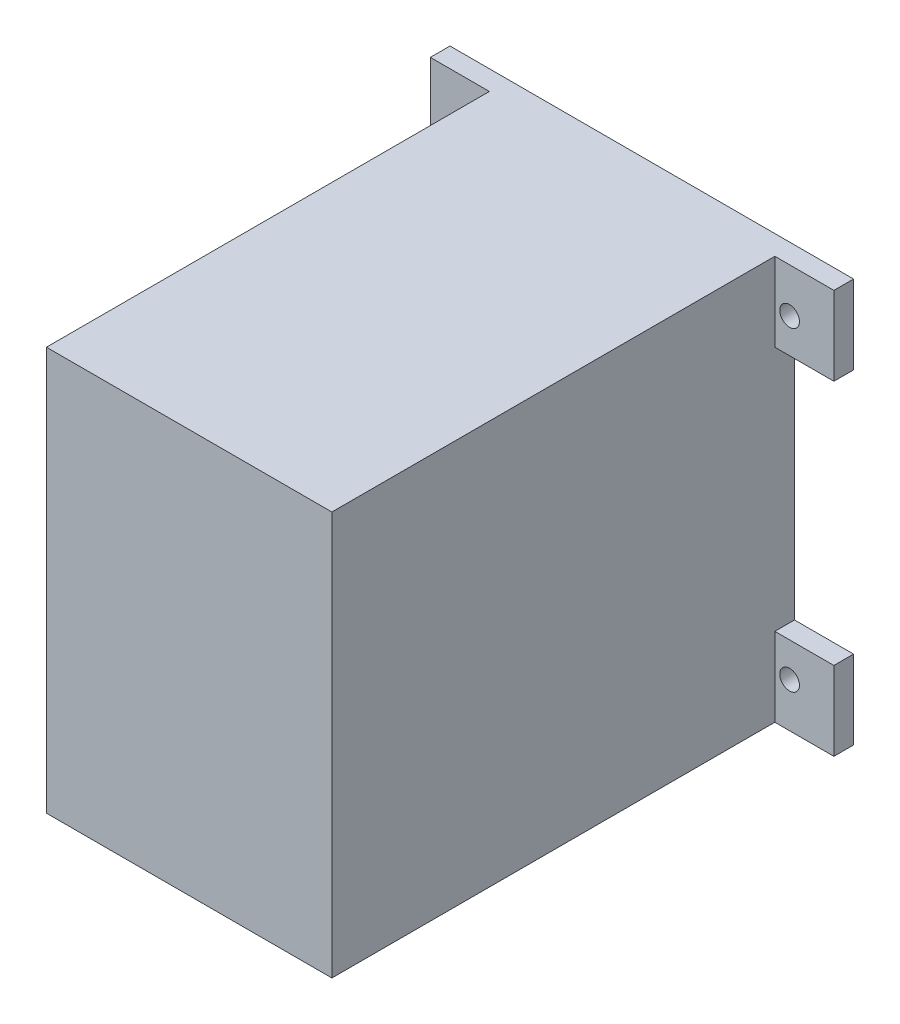
ISO-10303-21;
HEADER;
FILE_DESCRIPTION(('STEP AP214'),'2;1');
FILE_NAME('part.step','',(''),(''),'','','');
FILE_SCHEMA(('AUTOMOTIVE_DESIGN { 1 0 10303 214 1 1 1 1 }'));
ENDSEC;
DATA;
#1=APPLICATION_CONTEXT('core data for automotive mechanical design processes');
#2=APPLICATION_PROTOCOL_DEFINITION('international standard','automotive_design',2000,#1);
#3=PRODUCT_CONTEXT('',#1,'mechanical');
#4=PRODUCT('Part','Part','',(#3));
#5=PRODUCT_RELATED_PRODUCT_CATEGORY('part','',(#4));
#6=PRODUCT_DEFINITION_FORMATION('','',#4);
#7=PRODUCT_DEFINITION_CONTEXT('part definition',#1,'design');
#8=PRODUCT_DEFINITION('design','',#6,#7);
#9=PRODUCT_DEFINITION_SHAPE('','',#8);
#10=(LENGTH_UNIT() NAMED_UNIT(*) SI_UNIT(.MILLI.,.METRE.));
#11=(NAMED_UNIT(*) PLANE_ANGLE_UNIT() SI_UNIT($,.RADIAN.));
#12=(NAMED_UNIT(*) SI_UNIT($,.STERADIAN.) SOLID_ANGLE_UNIT());
#13=UNCERTAINTY_MEASURE_WITH_UNIT(LENGTH_MEASURE(1.E-05),#10,'distance_accuracy_value','');
#14=(GEOMETRIC_REPRESENTATION_CONTEXT(3) GLOBAL_UNCERTAINTY_ASSIGNED_CONTEXT((#13)) GLOBAL_UNIT_ASSIGNED_CONTEXT((#10,
#11,#12)) REPRESENTATION_CONTEXT('',''));
#15=CARTESIAN_POINT('',(0.,0.,0.));
#16=DIRECTION('',(0.,0.,1.));
#17=DIRECTION('',(1.,0.,0.));
#18=AXIS2_PLACEMENT_3D('',#15,#16,#17);
#19=CARTESIAN_POINT('',(-14.5,20.5,0.));
#20=DIRECTION('',(0.,0.,1.));
#21=DIRECTION('',(1.,0.,0.));
#22=AXIS2_PLACEMENT_3D('',#19,#20,#21);
#23=PLANE('',#22);
#24=CARTESIAN_POINT('',(16.,-16.,0.));
#25=DIRECTION('',(0.,0.,1.));
#26=DIRECTION('',(1.,0.,0.));
#27=AXIS2_PLACEMENT_3D('',#24,#25,#26);
#28=CIRCLE('',#27,1.00000000000001);
#29=CARTESIAN_POINT('',(17.,-16.,0.));
#30=VERTEX_POINT('',#29);
#31=EDGE_CURVE('E616',#30,#30,#28,.T.);
#32=ORIENTED_EDGE('',*,*,#31,.T.);
#33=EDGE_LOOP('',(#32));
#34=FACE_BOUND('',#33,.T.);
#35=CARTESIAN_POINT('',(-16.,16.,0.));
#36=DIRECTION('',(0.,0.,1.));
#37=DIRECTION('',(1.,0.,0.));
#38=AXIS2_PLACEMENT_3D('',#35,#36,#37);
#39=CIRCLE('',#38,1.);
#40=CARTESIAN_POINT('',(-15.,16.,0.));
#41=VERTEX_POINT('',#40);
#42=EDGE_CURVE('E627',#41,#41,#39,.T.);
#43=ORIENTED_EDGE('',*,*,#42,.T.);
#44=EDGE_LOOP('',(#43));
#45=FACE_BOUND('',#44,.T.);
#46=DIRECTION('',(0.,-1.,0.));
#47=VECTOR('',#46,1.);
#48=CARTESIAN_POINT('',(-14.5,-20.5,0.));
#49=LINE('',#48,#47);
#50=CARTESIAN_POINT('',(-14.5,12.5,0.));
#51=VERTEX_POINT('',#50);
#52=CARTESIAN_POINT('',(-14.5,-12.5,0.));
#53=VERTEX_POINT('',#52);
#54=EDGE_CURVE('E35',#51,#53,#49,.T.);
#55=ORIENTED_EDGE('',*,*,#54,.F.);
#56=DIRECTION('',(1.,0.,0.));
#57=VECTOR('',#56,1.);
#58=CARTESIAN_POINT('',(-14.5,12.5,0.));
#59=LINE('',#58,#57);
#60=CARTESIAN_POINT('',(-20.5,12.5,0.));
#61=VERTEX_POINT('',#60);
#62=EDGE_CURVE('E199',#61,#51,#59,.T.);
#63=ORIENTED_EDGE('',*,*,#62,.F.);
#64=DIRECTION('',(0.,-1.,0.));
#65=VECTOR('',#64,1.);
#66=CARTESIAN_POINT('',(-20.5,20.5,0.));
#67=LINE('',#66,#65);
#68=CARTESIAN_POINT('',(-20.5,20.5,0.));
#69=VERTEX_POINT('',#68);
#70=EDGE_CURVE('E197',#69,#61,#67,.T.);
#71=ORIENTED_EDGE('',*,*,#70,.F.);
#72=DIRECTION('',(-1.,0.,0.));
#73=VECTOR('',#72,1.);
#74=CARTESIAN_POINT('',(14.5,20.5,0.));
#75=LINE('',#74,#73);
#76=CARTESIAN_POINT('',(20.5,20.5,0.));
#77=VERTEX_POINT('',#76);
#78=EDGE_CURVE('E183',#77,#69,#75,.T.);
#79=ORIENTED_EDGE('',*,*,#78,.F.);
#80=DIRECTION('',(0.,1.,0.));
#81=VECTOR('',#80,1.);
#82=CARTESIAN_POINT('',(20.5,20.5,0.));
#83=LINE('',#82,#81);
#84=CARTESIAN_POINT('',(20.5,12.5,0.));
#85=VERTEX_POINT('',#84);
#86=EDGE_CURVE('E312',#85,#77,#83,.T.);
#87=ORIENTED_EDGE('',*,*,#86,.F.);
#88=DIRECTION('',(1.,0.,0.));
#89=VECTOR('',#88,1.);
#90=CARTESIAN_POINT('',(14.5,12.5,0.));
#91=LINE('',#90,#89);
#92=CARTESIAN_POINT('',(14.5,12.5,0.));
#93=VERTEX_POINT('',#92);
#94=EDGE_CURVE('E310',#93,#85,#91,.T.);
#95=ORIENTED_EDGE('',*,*,#94,.F.);
#96=DIRECTION('',(0.,1.,0.));
#97=VECTOR('',#96,1.);
#98=CARTESIAN_POINT('',(14.5,-20.5,0.));
#99=LINE('',#98,#97);
#100=CARTESIAN_POINT('',(14.5,-12.5,0.));
#101=VERTEX_POINT('',#100);
#102=EDGE_CURVE('E240',#101,#93,#99,.T.);
#103=ORIENTED_EDGE('',*,*,#102,.F.);
#104=DIRECTION('',(-1.,0.,0.));
#105=VECTOR('',#104,1.);
#106=CARTESIAN_POINT('',(14.5,-12.5,0.));
#107=LINE('',#106,#105);
#108=CARTESIAN_POINT('',(20.5,-12.5,0.));
#109=VERTEX_POINT('',#108);
#110=EDGE_CURVE('E365',#109,#101,#107,.T.);
#111=ORIENTED_EDGE('',*,*,#110,.F.);
#112=DIRECTION('',(0.,1.,0.));
#113=VECTOR('',#112,1.);
#114=CARTESIAN_POINT('',(20.5,-20.5,0.));
#115=LINE('',#114,#113);
#116=CARTESIAN_POINT('',(20.5,-20.5,0.));
#117=VERTEX_POINT('',#116);
#118=EDGE_CURVE('E227',#117,#109,#115,.T.);
#119=ORIENTED_EDGE('',*,*,#118,.F.);
#120=DIRECTION('',(1.,0.,0.));
#121=VECTOR('',#120,1.);
#122=CARTESIAN_POINT('',(14.5,-20.5,0.));
#123=LINE('',#122,#121);
#124=CARTESIAN_POINT('',(-20.5,-20.5,0.));
#125=VERTEX_POINT('',#124);
#126=EDGE_CURVE('E260',#125,#117,#123,.T.);
#127=ORIENTED_EDGE('',*,*,#126,.F.);
#128=DIRECTION('',(0.,-1.,0.));
#129=VECTOR('',#128,1.);
#130=CARTESIAN_POINT('',(-20.5,-20.5,0.));
#131=LINE('',#130,#129);
#132=CARTESIAN_POINT('',(-20.5,-12.5,0.));
#133=VERTEX_POINT('',#132);
#134=EDGE_CURVE('E211',#133,#125,#131,.T.);
#135=ORIENTED_EDGE('',*,*,#134,.F.);
#136=DIRECTION('',(-1.,0.,0.));
#137=VECTOR('',#136,1.);
#138=CARTESIAN_POINT('',(-14.5,-12.5,0.));
#139=LINE('',#138,#137);
#140=EDGE_CURVE('E186',#53,#133,#139,.T.);
#141=ORIENTED_EDGE('',*,*,#140,.F.);
#142=EDGE_LOOP('',(#55,#63,#71,#79,#87,#95,#103,#111,#119,#127,#135,#141));
#143=FACE_BOUND('',#142,.T.);
#144=DIRECTION('',(0.,-1.,0.));
#145=VECTOR('',#144,1.);
#146=CARTESIAN_POINT('',(-13.25,-19.25,0.));
#147=LINE('',#146,#145);
#148=CARTESIAN_POINT('',(-13.25,19.25,0.));
#149=VERTEX_POINT('',#148);
#150=CARTESIAN_POINT('',(-13.25,-19.25,0.));
#151=VERTEX_POINT('',#150);
#152=EDGE_CURVE('E291',#149,#151,#147,.T.);
#153=ORIENTED_EDGE('',*,*,#152,.T.);
#154=DIRECTION('',(1.,0.,0.));
#155=VECTOR('',#154,1.);
#156=CARTESIAN_POINT('',(13.25,-19.25,0.));
#157=LINE('',#156,#155);
#158=CARTESIAN_POINT('',(13.25,-19.25,0.));
#159=VERTEX_POINT('',#158);
#160=EDGE_CURVE('E288',#151,#159,#157,.T.);
#161=ORIENTED_EDGE('',*,*,#160,.T.);
#162=DIRECTION('',(0.,1.,0.));
#163=VECTOR('',#162,1.);
#164=CARTESIAN_POINT('',(13.25,-19.25,0.));
#165=LINE('',#164,#163);
#166=CARTESIAN_POINT('',(13.25,19.25,0.));
#167=VERTEX_POINT('',#166);
#168=EDGE_CURVE('E285',#159,#167,#165,.T.);
#169=ORIENTED_EDGE('',*,*,#168,.T.);
#170=DIRECTION('',(-1.,0.,0.));
#171=VECTOR('',#170,1.);
#172=CARTESIAN_POINT('',(13.25,19.25,0.));
#173=LINE('',#172,#171);
#174=EDGE_CURVE('E281',#167,#149,#173,.T.);
#175=ORIENTED_EDGE('',*,*,#174,.T.);
#176=EDGE_LOOP('',(#153,#161,#169,#175));
#177=FACE_BOUND('',#176,.T.);
#178=CARTESIAN_POINT('',(-16.,-16.,0.));
#179=DIRECTION('',(0.,0.,1.));
#180=DIRECTION('',(1.,0.,0.));
#181=AXIS2_PLACEMENT_3D('',#178,#179,#180);
#182=CIRCLE('',#181,1.);
#183=CARTESIAN_POINT('',(-15.,-16.,0.));
#184=VERTEX_POINT('',#183);
#185=EDGE_CURVE('E622',#184,#184,#182,.T.);
#186=ORIENTED_EDGE('',*,*,#185,.T.);
#187=EDGE_LOOP('',(#186));
#188=FACE_BOUND('',#187,.T.);
#189=CARTESIAN_POINT('',(16.,16.,0.));
#190=DIRECTION('',(0.,0.,1.));
#191=DIRECTION('',(1.,0.,0.));
#192=AXIS2_PLACEMENT_3D('',#189,#190,#191);
#193=CIRCLE('',#192,1.);
#194=CARTESIAN_POINT('',(17.,16.,0.));
#195=VERTEX_POINT('',#194);
#196=EDGE_CURVE('E613',#195,#195,#193,.T.);
#197=ORIENTED_EDGE('',*,*,#196,.T.);
#198=EDGE_LOOP('',(#197));
#199=FACE_BOUND('',#198,.T.);
#200=ADVANCED_FACE('F31',(#34,#45,#143,#177,#188,#199),#23,.F.);
#201=CARTESIAN_POINT('',(14.5,12.5,2.));
#202=DIRECTION('',(0.,0.,1.));
#203=DIRECTION('',(1.,0.,0.));
#204=AXIS2_PLACEMENT_3D('',#201,#202,#203);
#205=PLANE('',#204);
#206=DIRECTION('',(0.,-1.,0.));
#207=VECTOR('',#206,1.);
#208=CARTESIAN_POINT('',(14.5,20.5,2.));
#209=LINE('',#208,#207);
#210=CARTESIAN_POINT('',(14.5,20.5,2.));
#211=VERTEX_POINT('',#210);
#212=CARTESIAN_POINT('',(14.5,12.5,2.));
#213=VERTEX_POINT('',#212);
#214=EDGE_CURVE('E251',#211,#213,#209,.T.);
#215=ORIENTED_EDGE('',*,*,#214,.T.);
#216=DIRECTION('',(1.,0.,0.));
#217=VECTOR('',#216,1.);
#218=CARTESIAN_POINT('',(14.5,12.5,2.));
#219=LINE('',#218,#217);
#220=CARTESIAN_POINT('',(20.5,12.5,2.));
#221=VERTEX_POINT('',#220);
#222=EDGE_CURVE('E324',#213,#221,#219,.T.);
#223=ORIENTED_EDGE('',*,*,#222,.T.);
#224=DIRECTION('',(0.,1.,0.));
#225=VECTOR('',#224,1.);
#226=CARTESIAN_POINT('',(20.5,20.5,2.));
#227=LINE('',#226,#225);
#228=CARTESIAN_POINT('',(20.5,20.5,2.));
#229=VERTEX_POINT('',#228);
#230=EDGE_CURVE('E319',#221,#229,#227,.T.);
#231=ORIENTED_EDGE('',*,*,#230,.T.);
#232=DIRECTION('',(-1.,0.,0.));
#233=VECTOR('',#232,1.);
#234=CARTESIAN_POINT('',(14.5,20.5,2.));
#235=LINE('',#234,#233);
#236=EDGE_CURVE('E316',#229,#211,#235,.T.);
#237=ORIENTED_EDGE('',*,*,#236,.T.);
#238=EDGE_LOOP('',(#215,#223,#231,#237));
#239=FACE_BOUND('',#238,.T.);
#240=CARTESIAN_POINT('',(16.,16.,2.));
#241=DIRECTION('',(0.,0.,1.));
#242=DIRECTION('',(1.,0.,0.));
#243=AXIS2_PLACEMENT_3D('',#240,#241,#242);
#244=CIRCLE('',#243,1.);
#245=CARTESIAN_POINT('',(17.,16.,2.));
#246=VERTEX_POINT('',#245);
#247=EDGE_CURVE('E610',#246,#246,#244,.T.);
#248=ORIENTED_EDGE('',*,*,#247,.F.);
#249=EDGE_LOOP('',(#248));
#250=FACE_BOUND('',#249,.T.);
#251=ADVANCED_FACE('F335',(#239,#250),#205,.T.);
#252=CARTESIAN_POINT('',(14.5,-12.5,2.));
#253=DIRECTION('',(0.,0.,-1.));
#254=DIRECTION('',(-1.,0.,0.));
#255=AXIS2_PLACEMENT_3D('',#252,#253,#254);
#256=PLANE('',#255);
#257=DIRECTION('',(0.,-1.,0.));
#258=VECTOR('',#257,1.);
#259=CARTESIAN_POINT('',(14.5,-20.5,2.));
#260=LINE('',#259,#258);
#261=CARTESIAN_POINT('',(14.5,-12.5,2.));
#262=VERTEX_POINT('',#261);
#263=CARTESIAN_POINT('',(14.5,-20.5,2.));
#264=VERTEX_POINT('',#263);
#265=EDGE_CURVE('E223',#262,#264,#260,.T.);
#266=ORIENTED_EDGE('',*,*,#265,.T.);
#267=DIRECTION('',(1.,0.,0.));
#268=VECTOR('',#267,1.);
#269=CARTESIAN_POINT('',(14.5,-20.5,2.));
#270=LINE('',#269,#268);
#271=CARTESIAN_POINT('',(20.5,-20.5,2.));
#272=VERTEX_POINT('',#271);
#273=EDGE_CURVE('E354',#264,#272,#270,.T.);
#274=ORIENTED_EDGE('',*,*,#273,.T.);
#275=DIRECTION('',(0.,1.,0.));
#276=VECTOR('',#275,1.);
#277=CARTESIAN_POINT('',(20.5,-20.5,2.));
#278=LINE('',#277,#276);
#279=CARTESIAN_POINT('',(20.5,-12.5,2.));
#280=VERTEX_POINT('',#279);
#281=EDGE_CURVE('E359',#272,#280,#278,.T.);
#282=ORIENTED_EDGE('',*,*,#281,.T.);
#283=DIRECTION('',(-1.,0.,0.));
#284=VECTOR('',#283,1.);
#285=CARTESIAN_POINT('',(14.5,-12.5,2.));
#286=LINE('',#285,#284);
#287=EDGE_CURVE('E363',#280,#262,#286,.T.);
#288=ORIENTED_EDGE('',*,*,#287,.T.);
#289=EDGE_LOOP('',(#266,#274,#282,#288));
#290=FACE_BOUND('',#289,.T.);
#291=CARTESIAN_POINT('',(16.,-16.,2.));
#292=DIRECTION('',(0.,0.,1.));
#293=DIRECTION('',(1.,0.,0.));
#294=AXIS2_PLACEMENT_3D('',#291,#292,#293);
#295=CIRCLE('',#294,1.00000000000001);
#296=CARTESIAN_POINT('',(17.,-16.,2.));
#297=VERTEX_POINT('',#296);
#298=EDGE_CURVE('E619',#297,#297,#295,.T.);
#299=ORIENTED_EDGE('',*,*,#298,.F.);
#300=EDGE_LOOP('',(#299));
#301=FACE_BOUND('',#300,.T.);
#302=ADVANCED_FACE('F360',(#290,#301),#256,.F.);
#303=CARTESIAN_POINT('',(-14.5,-12.5,2.));
#304=DIRECTION('',(0.,0.,1.));
#305=DIRECTION('',(1.,0.,0.));
#306=AXIS2_PLACEMENT_3D('',#303,#304,#305);
#307=PLANE('',#306);
#308=DIRECTION('',(0.,1.,0.));
#309=VECTOR('',#308,1.);
#310=CARTESIAN_POINT('',(-14.5,-20.5,2.));
#311=LINE('',#310,#309);
#312=CARTESIAN_POINT('',(-14.5,-20.5,2.));
#313=VERTEX_POINT('',#312);
#314=CARTESIAN_POINT('',(-14.5,-12.5,2.));
#315=VERTEX_POINT('',#314);
#316=EDGE_CURVE('E208',#313,#315,#311,.T.);
#317=ORIENTED_EDGE('',*,*,#316,.T.);
#318=DIRECTION('',(-1.,0.,0.));
#319=VECTOR('',#318,1.);
#320=CARTESIAN_POINT('',(-14.5,-12.5,2.));
#321=LINE('',#320,#319);
#322=CARTESIAN_POINT('',(-20.5,-12.5,2.));
#323=VERTEX_POINT('',#322);
#324=EDGE_CURVE('E205',#315,#323,#321,.T.);
#325=ORIENTED_EDGE('',*,*,#324,.T.);
#326=DIRECTION('',(0.,-1.,0.));
#327=VECTOR('',#326,1.);
#328=CARTESIAN_POINT('',(-20.5,-20.5,2.));
#329=LINE('',#328,#327);
#330=CARTESIAN_POINT('',(-20.5,-20.5,2.));
#331=VERTEX_POINT('',#330);
#332=EDGE_CURVE('E207',#323,#331,#329,.T.);
#333=ORIENTED_EDGE('',*,*,#332,.T.);
#334=DIRECTION('',(1.,0.,0.));
#335=VECTOR('',#334,1.);
#336=CARTESIAN_POINT('',(-14.5,-20.5,2.));
#337=LINE('',#336,#335);
#338=EDGE_CURVE('E210',#331,#313,#337,.T.);
#339=ORIENTED_EDGE('',*,*,#338,.T.);
#340=EDGE_LOOP('',(#317,#325,#333,#339));
#341=FACE_BOUND('',#340,.T.);
#342=CARTESIAN_POINT('',(-16.,-16.,2.));
#343=DIRECTION('',(0.,0.,1.));
#344=DIRECTION('',(1.,0.,0.));
#345=AXIS2_PLACEMENT_3D('',#342,#343,#344);
#346=CIRCLE('',#345,1.);
#347=CARTESIAN_POINT('',(-15.,-16.,2.));
#348=VERTEX_POINT('',#347);
#349=EDGE_CURVE('E624',#348,#348,#346,.T.);
#350=ORIENTED_EDGE('',*,*,#349,.F.);
#351=EDGE_LOOP('',(#350));
#352=FACE_BOUND('',#351,.T.);
#353=ADVANCED_FACE('F551',(#341,#352),#307,.T.);
#354=CARTESIAN_POINT('',(-14.5,12.5,2.));
#355=DIRECTION('',(0.,0.,-1.));
#356=DIRECTION('',(-1.,0.,0.));
#357=AXIS2_PLACEMENT_3D('',#354,#355,#356);
#358=PLANE('',#357);
#359=DIRECTION('',(0.,1.,0.));
#360=VECTOR('',#359,1.);
#361=CARTESIAN_POINT('',(-14.5,20.5,2.));
#362=LINE('',#361,#360);
#363=CARTESIAN_POINT('',(-14.5,12.5,2.));
#364=VERTEX_POINT('',#363);
#365=CARTESIAN_POINT('',(-14.5,20.5,2.));
#366=VERTEX_POINT('',#365);
#367=EDGE_CURVE('E49',#364,#366,#362,.T.);
#368=ORIENTED_EDGE('',*,*,#367,.T.);
#369=DIRECTION('',(-1.,0.,0.));
#370=VECTOR('',#369,1.);
#371=CARTESIAN_POINT('',(-14.5,20.5,2.));
#372=LINE('',#371,#370);
#373=CARTESIAN_POINT('',(-20.5,20.5,2.));
#374=VERTEX_POINT('',#373);
#375=EDGE_CURVE('E169',#366,#374,#372,.T.);
#376=ORIENTED_EDGE('',*,*,#375,.T.);
#377=DIRECTION('',(0.,-1.,0.));
#378=VECTOR('',#377,1.);
#379=CARTESIAN_POINT('',(-20.5,20.5,2.));
#380=LINE('',#379,#378);
#381=CARTESIAN_POINT('',(-20.5,12.5,2.));
#382=VERTEX_POINT('',#381);
#383=EDGE_CURVE('E174',#374,#382,#380,.T.);
#384=ORIENTED_EDGE('',*,*,#383,.T.);
#385=DIRECTION('',(1.,0.,0.));
#386=VECTOR('',#385,1.);
#387=CARTESIAN_POINT('',(-14.5,12.5,2.));
#388=LINE('',#387,#386);
#389=EDGE_CURVE('E192',#382,#364,#388,.T.);
#390=ORIENTED_EDGE('',*,*,#389,.T.);
#391=EDGE_LOOP('',(#368,#376,#384,#390));
#392=FACE_BOUND('',#391,.T.);
#393=CARTESIAN_POINT('',(-16.,16.,2.));
#394=DIRECTION('',(0.,0.,1.));
#395=DIRECTION('',(1.,0.,0.));
#396=AXIS2_PLACEMENT_3D('',#393,#394,#395);
#397=CIRCLE('',#396,1.);
#398=CARTESIAN_POINT('',(-15.,16.,2.));
#399=VERTEX_POINT('',#398);
#400=EDGE_CURVE('E200',#399,#399,#397,.T.);
#401=ORIENTED_EDGE('',*,*,#400,.F.);
#402=EDGE_LOOP('',(#401));
#403=FACE_BOUND('',#402,.T.);
#404=ADVANCED_FACE('F171',(#392,#403),#358,.F.);
#405=CARTESIAN_POINT('',(-14.5,-20.5,47.));
#406=DIRECTION('',(1.,0.,0.));
#407=DIRECTION('',(0.,0.,-1.));
#408=AXIS2_PLACEMENT_3D('',#405,#406,#407);
#409=PLANE('',#408);
#410=DIRECTION('',(0.,0.,-1.));
#411=VECTOR('',#410,1.);
#412=CARTESIAN_POINT('',(-14.5,12.5,2.));
#413=LINE('',#412,#411);
#414=EDGE_CURVE('E54',#364,#51,#413,.T.);
#415=ORIENTED_EDGE('',*,*,#414,.T.);
#416=ORIENTED_EDGE('',*,*,#54,.T.);
#417=DIRECTION('',(0.,0.,-1.));
#418=VECTOR('',#417,1.);
#419=CARTESIAN_POINT('',(-14.5,-12.5,2.));
#420=LINE('',#419,#418);
#421=EDGE_CURVE('E220',#315,#53,#420,.T.);
#422=ORIENTED_EDGE('',*,*,#421,.F.);
#423=ORIENTED_EDGE('',*,*,#316,.F.);
#424=DIRECTION('',(0.,0.,-1.));
#425=VECTOR('',#424,1.);
#426=CARTESIAN_POINT('',(-14.5,-20.5,47.));
#427=LINE('',#426,#425);
#428=CARTESIAN_POINT('',(-14.5,-20.5,47.));
#429=VERTEX_POINT('',#428);
#430=EDGE_CURVE('E11',#429,#313,#427,.T.);
#431=ORIENTED_EDGE('',*,*,#430,.F.);
#432=DIRECTION('',(0.,-1.,0.));
#433=VECTOR('',#432,1.);
#434=CARTESIAN_POINT('',(-14.5,-20.5,47.));
#435=LINE('',#434,#433);
#436=CARTESIAN_POINT('',(-14.5,20.5,47.));
#437=VERTEX_POINT('',#436);
#438=EDGE_CURVE('E257',#437,#429,#435,.T.);
#439=ORIENTED_EDGE('',*,*,#438,.F.);
#440=DIRECTION('',(0.,0.,-1.));
#441=VECTOR('',#440,1.);
#442=CARTESIAN_POINT('',(-14.5,20.5,47.));
#443=LINE('',#442,#441);
#444=EDGE_CURVE('E250',#437,#366,#443,.T.);
#445=ORIENTED_EDGE('',*,*,#444,.T.);
#446=ORIENTED_EDGE('',*,*,#367,.F.);
#447=EDGE_LOOP('',(#415,#416,#422,#423,#431,#439,#445,#446));
#448=FACE_BOUND('',#447,.T.);
#449=ADVANCED_FACE('F33',(#448),#409,.F.);
#450=CARTESIAN_POINT('',(14.5,-20.5,47.));
#451=DIRECTION('',(-1.,0.,0.));
#452=DIRECTION('',(0.,0.,1.));
#453=AXIS2_PLACEMENT_3D('',#450,#451,#452);
#454=PLANE('',#453);
#455=DIRECTION('',(0.,0.,-1.));
#456=VECTOR('',#455,1.);
#457=CARTESIAN_POINT('',(14.5,-12.5,2.));
#458=LINE('',#457,#456);
#459=EDGE_CURVE('E374',#262,#101,#458,.T.);
#460=ORIENTED_EDGE('',*,*,#459,.T.);
#461=ORIENTED_EDGE('',*,*,#102,.T.);
#462=DIRECTION('',(0.,0.,-1.));
#463=VECTOR('',#462,1.);
#464=CARTESIAN_POINT('',(14.5,12.5,2.));
#465=LINE('',#464,#463);
#466=EDGE_CURVE('E294',#213,#93,#465,.T.);
#467=ORIENTED_EDGE('',*,*,#466,.F.);
#468=ORIENTED_EDGE('',*,*,#214,.F.);
#469=DIRECTION('',(0.,0.,-1.));
#470=VECTOR('',#469,1.);
#471=CARTESIAN_POINT('',(14.5,20.5,47.));
#472=LINE('',#471,#470);
#473=CARTESIAN_POINT('',(14.5,20.5,47.));
#474=VERTEX_POINT('',#473);
#475=EDGE_CURVE('E247',#474,#211,#472,.T.);
#476=ORIENTED_EDGE('',*,*,#475,.F.);
#477=DIRECTION('',(0.,1.,0.));
#478=VECTOR('',#477,1.);
#479=CARTESIAN_POINT('',(14.5,-20.5,47.));
#480=LINE('',#479,#478);
#481=CARTESIAN_POINT('',(14.5,-20.5,47.));
#482=VERTEX_POINT('',#481);
#483=EDGE_CURVE('E264',#482,#474,#480,.T.);
#484=ORIENTED_EDGE('',*,*,#483,.F.);
#485=DIRECTION('',(0.,0.,-1.));
#486=VECTOR('',#485,1.);
#487=CARTESIAN_POINT('',(14.5,-20.5,47.));
#488=LINE('',#487,#486);
#489=EDGE_CURVE('E41',#482,#264,#488,.T.);
#490=ORIENTED_EDGE('',*,*,#489,.T.);
#491=ORIENTED_EDGE('',*,*,#265,.F.);
#492=EDGE_LOOP('',(#460,#461,#467,#468,#476,#484,#490,#491));
#493=FACE_BOUND('',#492,.T.);
#494=ADVANCED_FACE('F341',(#493),#454,.F.);
#495=CARTESIAN_POINT('',(14.5,-20.5,47.));
#496=DIRECTION('',(0.,1.,0.));
#497=DIRECTION('',(-1.,0.,0.));
#498=AXIS2_PLACEMENT_3D('',#495,#496,#497);
#499=PLANE('',#498);
#500=ORIENTED_EDGE('',*,*,#126,.T.);
#501=DIRECTION('',(0.,0.,-1.));
#502=VECTOR('',#501,1.);
#503=CARTESIAN_POINT('',(20.5,-20.5,2.));
#504=LINE('',#503,#502);
#505=EDGE_CURVE('E313',#272,#117,#504,.T.);
#506=ORIENTED_EDGE('',*,*,#505,.F.);
#507=ORIENTED_EDGE('',*,*,#273,.F.);
#508=ORIENTED_EDGE('',*,*,#489,.F.);
#509=DIRECTION('',(1.,0.,0.));
#510=VECTOR('',#509,1.);
#511=CARTESIAN_POINT('',(14.5,-20.5,47.));
#512=LINE('',#511,#510);
#513=EDGE_CURVE('E266',#429,#482,#512,.T.);
#514=ORIENTED_EDGE('',*,*,#513,.F.);
#515=ORIENTED_EDGE('',*,*,#430,.T.);
#516=ORIENTED_EDGE('',*,*,#338,.F.);
#517=DIRECTION('',(0.,0.,-1.));
#518=VECTOR('',#517,1.);
#519=CARTESIAN_POINT('',(-20.5,-20.5,2.));
#520=LINE('',#519,#518);
#521=EDGE_CURVE('E214',#331,#125,#520,.T.);
#522=ORIENTED_EDGE('',*,*,#521,.T.);
#523=EDGE_LOOP('',(#500,#506,#507,#508,#514,#515,#516,#522));
#524=FACE_BOUND('',#523,.T.);
#525=ADVANCED_FACE('F355',(#524),#499,.F.);
#526=CARTESIAN_POINT('',(14.5,20.5,47.));
#527=DIRECTION('',(0.,-1.,0.));
#528=DIRECTION('',(1.,0.,0.));
#529=AXIS2_PLACEMENT_3D('',#526,#527,#528);
#530=PLANE('',#529);
#531=ORIENTED_EDGE('',*,*,#78,.T.);
#532=DIRECTION('',(0.,0.,-1.));
#533=VECTOR('',#532,1.);
#534=CARTESIAN_POINT('',(-20.5,20.5,2.));
#535=LINE('',#534,#533);
#536=EDGE_CURVE('E180',#374,#69,#535,.T.);
#537=ORIENTED_EDGE('',*,*,#536,.F.);
#538=ORIENTED_EDGE('',*,*,#375,.F.);
#539=ORIENTED_EDGE('',*,*,#444,.F.);
#540=DIRECTION('',(-1.,0.,0.));
#541=VECTOR('',#540,1.);
#542=CARTESIAN_POINT('',(14.5,20.5,47.));
#543=LINE('',#542,#541);
#544=EDGE_CURVE('E256',#474,#437,#543,.T.);
#545=ORIENTED_EDGE('',*,*,#544,.F.);
#546=ORIENTED_EDGE('',*,*,#475,.T.);
#547=ORIENTED_EDGE('',*,*,#236,.F.);
#548=DIRECTION('',(0.,0.,-1.));
#549=VECTOR('',#548,1.);
#550=CARTESIAN_POINT('',(20.5,20.5,2.));
#551=LINE('',#550,#549);
#552=EDGE_CURVE('E318',#229,#77,#551,.T.);
#553=ORIENTED_EDGE('',*,*,#552,.T.);
#554=EDGE_LOOP('',(#531,#537,#538,#539,#545,#546,#547,#553));
#555=FACE_BOUND('',#554,.T.);
#556=ADVANCED_FACE('F181',(#555),#530,.F.);
#557=CARTESIAN_POINT('',(-14.5,20.5,47.));
#558=DIRECTION('',(0.,0.,1.));
#559=DIRECTION('',(1.,0.,0.));
#560=AXIS2_PLACEMENT_3D('',#557,#558,#559);
#561=PLANE('',#560);
#562=ORIENTED_EDGE('',*,*,#438,.T.);
#563=ORIENTED_EDGE('',*,*,#513,.T.);
#564=ORIENTED_EDGE('',*,*,#483,.T.);
#565=ORIENTED_EDGE('',*,*,#544,.T.);
#566=EDGE_LOOP('',(#562,#563,#564,#565));
#567=FACE_BOUND('',#566,.T.);
#568=ADVANCED_FACE('F346',(#567),#561,.T.);
#569=CARTESIAN_POINT('',(-13.25,-19.25,46.));
#570=DIRECTION('',(1.,0.,0.));
#571=DIRECTION('',(0.,0.,-1.));
#572=AXIS2_PLACEMENT_3D('',#569,#570,#571);
#573=PLANE('',#572);
#574=ORIENTED_EDGE('',*,*,#152,.F.);
#575=DIRECTION('',(0.,0.,-1.));
#576=VECTOR('',#575,1.);
#577=CARTESIAN_POINT('',(-13.25,19.25,46.));
#578=LINE('',#577,#576);
#579=CARTESIAN_POINT('',(-13.25,19.25,46.));
#580=VERTEX_POINT('',#579);
#581=EDGE_CURVE('E277',#580,#149,#578,.T.);
#582=ORIENTED_EDGE('',*,*,#581,.F.);
#583=DIRECTION('',(0.,-1.,0.));
#584=VECTOR('',#583,1.);
#585=CARTESIAN_POINT('',(-13.25,-19.25,46.));
#586=LINE('',#585,#584);
#587=CARTESIAN_POINT('',(-13.25,-19.25,46.));
#588=VERTEX_POINT('',#587);
#589=EDGE_CURVE('E284',#580,#588,#586,.T.);
#590=ORIENTED_EDGE('',*,*,#589,.T.);
#591=DIRECTION('',(0.,0.,-1.));
#592=VECTOR('',#591,1.);
#593=CARTESIAN_POINT('',(-13.25,-19.25,46.));
#594=LINE('',#593,#592);
#595=EDGE_CURVE('E270',#588,#151,#594,.T.);
#596=ORIENTED_EDGE('',*,*,#595,.T.);
#597=EDGE_LOOP('',(#574,#582,#590,#596));
#598=FACE_BOUND('',#597,.T.);
#599=ADVANCED_FACE('F433',(#598),#573,.T.);
#600=CARTESIAN_POINT('',(13.25,-19.25,46.));
#601=DIRECTION('',(0.,1.,0.));
#602=DIRECTION('',(-1.,0.,0.));
#603=AXIS2_PLACEMENT_3D('',#600,#601,#602);
#604=PLANE('',#603);
#605=ORIENTED_EDGE('',*,*,#160,.F.);
#606=ORIENTED_EDGE('',*,*,#595,.F.);
#607=DIRECTION('',(1.,0.,0.));
#608=VECTOR('',#607,1.);
#609=CARTESIAN_POINT('',(13.25,-19.25,46.));
#610=LINE('',#609,#608);
#611=CARTESIAN_POINT('',(13.25,-19.25,46.));
#612=VERTEX_POINT('',#611);
#613=EDGE_CURVE('E298',#588,#612,#610,.T.);
#614=ORIENTED_EDGE('',*,*,#613,.T.);
#615=DIRECTION('',(0.,0.,-1.));
#616=VECTOR('',#615,1.);
#617=CARTESIAN_POINT('',(13.25,-19.25,46.));
#618=LINE('',#617,#616);
#619=EDGE_CURVE('E273',#612,#159,#618,.T.);
#620=ORIENTED_EDGE('',*,*,#619,.T.);
#621=EDGE_LOOP('',(#605,#606,#614,#620));
#622=FACE_BOUND('',#621,.T.);
#623=ADVANCED_FACE('F439',(#622),#604,.T.);
#624=CARTESIAN_POINT('',(13.25,-19.25,46.));
#625=DIRECTION('',(-1.,0.,0.));
#626=DIRECTION('',(0.,0.,1.));
#627=AXIS2_PLACEMENT_3D('',#624,#625,#626);
#628=PLANE('',#627);
#629=ORIENTED_EDGE('',*,*,#168,.F.);
#630=ORIENTED_EDGE('',*,*,#619,.F.);
#631=DIRECTION('',(0.,1.,0.));
#632=VECTOR('',#631,1.);
#633=CARTESIAN_POINT('',(13.25,-19.25,46.));
#634=LINE('',#633,#632);
#635=CARTESIAN_POINT('',(13.25,19.25,46.));
#636=VERTEX_POINT('',#635);
#637=EDGE_CURVE('E296',#612,#636,#634,.T.);
#638=ORIENTED_EDGE('',*,*,#637,.T.);
#639=DIRECTION('',(0.,0.,-1.));
#640=VECTOR('',#639,1.);
#641=CARTESIAN_POINT('',(13.25,19.25,46.));
#642=LINE('',#641,#640);
#643=EDGE_CURVE('E275',#636,#167,#642,.T.);
#644=ORIENTED_EDGE('',*,*,#643,.T.);
#645=EDGE_LOOP('',(#629,#630,#638,#644));
#646=FACE_BOUND('',#645,.T.);
#647=ADVANCED_FACE('F446',(#646),#628,.T.);
#648=CARTESIAN_POINT('',(13.25,19.25,46.));
#649=DIRECTION('',(0.,-1.,0.));
#650=DIRECTION('',(1.,0.,0.));
#651=AXIS2_PLACEMENT_3D('',#648,#649,#650);
#652=PLANE('',#651);
#653=ORIENTED_EDGE('',*,*,#174,.F.);
#654=ORIENTED_EDGE('',*,*,#643,.F.);
#655=DIRECTION('',(-1.,0.,0.));
#656=VECTOR('',#655,1.);
#657=CARTESIAN_POINT('',(13.25,19.25,46.));
#658=LINE('',#657,#656);
#659=EDGE_CURVE('E280',#636,#580,#658,.T.);
#660=ORIENTED_EDGE('',*,*,#659,.T.);
#661=ORIENTED_EDGE('',*,*,#581,.T.);
#662=EDGE_LOOP('',(#653,#654,#660,#661));
#663=FACE_BOUND('',#662,.T.);
#664=ADVANCED_FACE('F454',(#663),#652,.T.);
#665=CARTESIAN_POINT('',(-13.25,19.25,46.));
#666=DIRECTION('',(0.,0.,1.));
#667=DIRECTION('',(1.,0.,0.));
#668=AXIS2_PLACEMENT_3D('',#665,#666,#667);
#669=PLANE('',#668);
#670=ORIENTED_EDGE('',*,*,#589,.F.);
#671=ORIENTED_EDGE('',*,*,#659,.F.);
#672=ORIENTED_EDGE('',*,*,#637,.F.);
#673=ORIENTED_EDGE('',*,*,#613,.F.);
#674=EDGE_LOOP('',(#670,#671,#672,#673));
#675=FACE_BOUND('',#674,.T.);
#676=ADVANCED_FACE('F462',(#675),#669,.F.);
#677=CARTESIAN_POINT('',(14.5,12.5,2.));
#678=DIRECTION('',(0.,1.,0.));
#679=DIRECTION('',(0.,0.,1.));
#680=AXIS2_PLACEMENT_3D('',#677,#678,#679);
#681=PLANE('',#680);
#682=ORIENTED_EDGE('',*,*,#94,.T.);
#683=DIRECTION('',(0.,0.,-1.));
#684=VECTOR('',#683,1.);
#685=CARTESIAN_POINT('',(20.5,12.5,2.));
#686=LINE('',#685,#684);
#687=EDGE_CURVE('E304',#221,#85,#686,.T.);
#688=ORIENTED_EDGE('',*,*,#687,.F.);
#689=ORIENTED_EDGE('',*,*,#222,.F.);
#690=ORIENTED_EDGE('',*,*,#466,.T.);
#691=EDGE_LOOP('',(#682,#688,#689,#690));
#692=FACE_BOUND('',#691,.T.);
#693=ADVANCED_FACE('F470',(#692),#681,.F.);
#694=CARTESIAN_POINT('',(20.5,20.5,2.));
#695=DIRECTION('',(-1.,0.,0.));
#696=DIRECTION('',(0.,0.,1.));
#697=AXIS2_PLACEMENT_3D('',#694,#695,#696);
#698=PLANE('',#697);
#699=ORIENTED_EDGE('',*,*,#86,.T.);
#700=ORIENTED_EDGE('',*,*,#552,.F.);
#701=ORIENTED_EDGE('',*,*,#230,.F.);
#702=ORIENTED_EDGE('',*,*,#687,.T.);
#703=EDGE_LOOP('',(#699,#700,#701,#702));
#704=FACE_BOUND('',#703,.T.);
#705=ADVANCED_FACE('F398',(#704),#698,.F.);
#706=CARTESIAN_POINT('',(20.5,-20.5,2.));
#707=DIRECTION('',(-1.,0.,0.));
#708=DIRECTION('',(0.,0.,1.));
#709=AXIS2_PLACEMENT_3D('',#706,#707,#708);
#710=PLANE('',#709);
#711=ORIENTED_EDGE('',*,*,#118,.T.);
#712=DIRECTION('',(0.,0.,-1.));
#713=VECTOR('',#712,1.);
#714=CARTESIAN_POINT('',(20.5,-12.5,2.));
#715=LINE('',#714,#713);
#716=EDGE_CURVE('E376',#280,#109,#715,.T.);
#717=ORIENTED_EDGE('',*,*,#716,.F.);
#718=ORIENTED_EDGE('',*,*,#281,.F.);
#719=ORIENTED_EDGE('',*,*,#505,.T.);
#720=EDGE_LOOP('',(#711,#717,#718,#719));
#721=FACE_BOUND('',#720,.T.);
#722=ADVANCED_FACE('F379',(#721),#710,.F.);
#723=CARTESIAN_POINT('',(14.5,-12.5,2.));
#724=DIRECTION('',(0.,-1.,0.));
#725=DIRECTION('',(0.,0.,-1.));
#726=AXIS2_PLACEMENT_3D('',#723,#724,#725);
#727=PLANE('',#726);
#728=ORIENTED_EDGE('',*,*,#110,.T.);
#729=ORIENTED_EDGE('',*,*,#459,.F.);
#730=ORIENTED_EDGE('',*,*,#287,.F.);
#731=ORIENTED_EDGE('',*,*,#716,.T.);
#732=EDGE_LOOP('',(#728,#729,#730,#731));
#733=FACE_BOUND('',#732,.T.);
#734=ADVANCED_FACE('F386',(#733),#727,.F.);
#735=CARTESIAN_POINT('',(-14.5,-12.5,2.));
#736=DIRECTION('',(0.,-1.,0.));
#737=DIRECTION('',(0.,0.,-1.));
#738=AXIS2_PLACEMENT_3D('',#735,#736,#737);
#739=PLANE('',#738);
#740=ORIENTED_EDGE('',*,*,#140,.T.);
#741=DIRECTION('',(0.,0.,-1.));
#742=VECTOR('',#741,1.);
#743=CARTESIAN_POINT('',(-20.5,-12.5,2.));
#744=LINE('',#743,#742);
#745=EDGE_CURVE('E217',#323,#133,#744,.T.);
#746=ORIENTED_EDGE('',*,*,#745,.F.);
#747=ORIENTED_EDGE('',*,*,#324,.F.);
#748=ORIENTED_EDGE('',*,*,#421,.T.);
#749=EDGE_LOOP('',(#740,#746,#747,#748));
#750=FACE_BOUND('',#749,.T.);
#751=ADVANCED_FACE('F389',(#750),#739,.F.);
#752=CARTESIAN_POINT('',(-20.5,-20.5,2.));
#753=DIRECTION('',(1.,0.,0.));
#754=DIRECTION('',(0.,0.,-1.));
#755=AXIS2_PLACEMENT_3D('',#752,#753,#754);
#756=PLANE('',#755);
#757=ORIENTED_EDGE('',*,*,#134,.T.);
#758=ORIENTED_EDGE('',*,*,#521,.F.);
#759=ORIENTED_EDGE('',*,*,#332,.F.);
#760=ORIENTED_EDGE('',*,*,#745,.T.);
#761=EDGE_LOOP('',(#757,#758,#759,#760));
#762=FACE_BOUND('',#761,.T.);
#763=ADVANCED_FACE('F395',(#762),#756,.F.);
#764=CARTESIAN_POINT('',(-20.5,20.5,2.));
#765=DIRECTION('',(1.,0.,0.));
#766=DIRECTION('',(0.,0.,-1.));
#767=AXIS2_PLACEMENT_3D('',#764,#765,#766);
#768=PLANE('',#767);
#769=ORIENTED_EDGE('',*,*,#70,.T.);
#770=DIRECTION('',(0.,0.,-1.));
#771=VECTOR('',#770,1.);
#772=CARTESIAN_POINT('',(-20.5,12.5,2.));
#773=LINE('',#772,#771);
#774=EDGE_CURVE('E187',#382,#61,#773,.T.);
#775=ORIENTED_EDGE('',*,*,#774,.F.);
#776=ORIENTED_EDGE('',*,*,#383,.F.);
#777=ORIENTED_EDGE('',*,*,#536,.T.);
#778=EDGE_LOOP('',(#769,#775,#776,#777));
#779=FACE_BOUND('',#778,.T.);
#780=ADVANCED_FACE('F189',(#779),#768,.F.);
#781=CARTESIAN_POINT('',(-14.5,12.5,2.));
#782=DIRECTION('',(0.,1.,0.));
#783=DIRECTION('',(0.,0.,1.));
#784=AXIS2_PLACEMENT_3D('',#781,#782,#783);
#785=PLANE('',#784);
#786=ORIENTED_EDGE('',*,*,#62,.T.);
#787=ORIENTED_EDGE('',*,*,#414,.F.);
#788=ORIENTED_EDGE('',*,*,#389,.F.);
#789=ORIENTED_EDGE('',*,*,#774,.T.);
#790=EDGE_LOOP('',(#786,#787,#788,#789));
#791=FACE_BOUND('',#790,.T.);
#792=ADVANCED_FACE('F517',(#791),#785,.F.);
#793=CARTESIAN_POINT('',(-16.,16.,2.));
#794=DIRECTION('',(0.,0.,-1.));
#795=DIRECTION('',(-1.,0.,0.));
#796=AXIS2_PLACEMENT_3D('',#793,#794,#795);
#797=CYLINDRICAL_SURFACE('',#796,1.);
#798=ORIENTED_EDGE('',*,*,#400,.T.);
#799=EDGE_LOOP('',(#798));
#800=FACE_BOUND('',#799,.T.);
#801=ORIENTED_EDGE('',*,*,#42,.F.);
#802=EDGE_LOOP('',(#801));
#803=FACE_BOUND('',#802,.T.);
#804=ADVANCED_FACE('F525',(#800,#803),#797,.F.);
#805=CARTESIAN_POINT('',(-16.,-16.,2.));
#806=DIRECTION('',(0.,0.,-1.));
#807=DIRECTION('',(-1.,0.,0.));
#808=AXIS2_PLACEMENT_3D('',#805,#806,#807);
#809=CYLINDRICAL_SURFACE('',#808,1.);
#810=ORIENTED_EDGE('',*,*,#349,.T.);
#811=EDGE_LOOP('',(#810));
#812=FACE_BOUND('',#811,.T.);
#813=ORIENTED_EDGE('',*,*,#185,.F.);
#814=EDGE_LOOP('',(#813));
#815=FACE_BOUND('',#814,.T.);
#816=ADVANCED_FACE('F573',(#812,#815),#809,.F.);
#817=CARTESIAN_POINT('',(16.,-16.,2.));
#818=DIRECTION('',(0.,0.,-1.));
#819=DIRECTION('',(-1.,0.,0.));
#820=AXIS2_PLACEMENT_3D('',#817,#818,#819);
#821=CYLINDRICAL_SURFACE('',#820,1.00000000000001);
#822=ORIENTED_EDGE('',*,*,#298,.T.);
#823=EDGE_LOOP('',(#822));
#824=FACE_BOUND('',#823,.T.);
#825=ORIENTED_EDGE('',*,*,#31,.F.);
#826=EDGE_LOOP('',(#825));
#827=FACE_BOUND('',#826,.T.);
#828=ADVANCED_FACE('F583',(#824,#827),#821,.F.);
#829=CARTESIAN_POINT('',(16.,16.,2.));
#830=DIRECTION('',(0.,0.,-1.));
#831=DIRECTION('',(-1.,0.,0.));
#832=AXIS2_PLACEMENT_3D('',#829,#830,#831);
#833=CYLINDRICAL_SURFACE('',#832,1.);
#834=ORIENTED_EDGE('',*,*,#247,.T.);
#835=EDGE_LOOP('',(#834));
#836=FACE_BOUND('',#835,.T.);
#837=ORIENTED_EDGE('',*,*,#196,.F.);
#838=EDGE_LOOP('',(#837));
#839=FACE_BOUND('',#838,.T.);
#840=ADVANCED_FACE('F593',(#836,#839),#833,.F.);
#841=CLOSED_SHELL('',(#200,#251,#302,#353,#404,#449,#494,#525,#556,#568,#599,#623,#647,#664,
#676,#693,#705,#722,#734,#751,#763,#780,#792,#804,#816,#828,#840));
#842=MANIFOLD_SOLID_BREP('B2',#841);
#843=ADVANCED_BREP_SHAPE_REPRESENTATION('',(#18,#842),#14);
#844=SHAPE_DEFINITION_REPRESENTATION(#9,#843);
ENDSEC;
END-ISO-10303-21;
